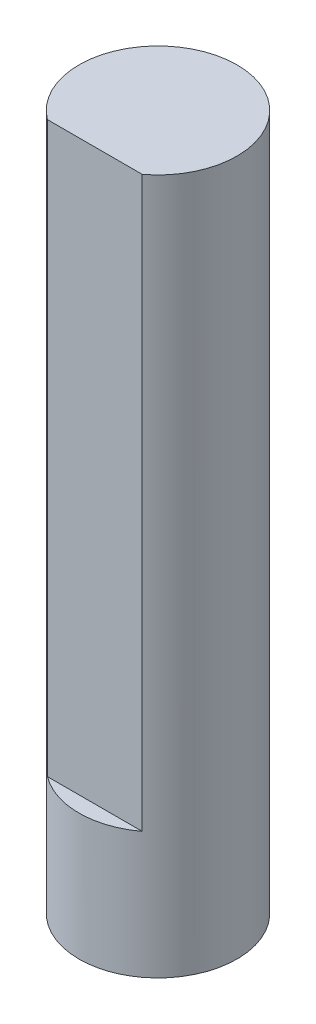
ISO-10303-21;
HEADER;
FILE_DESCRIPTION(('STEP AP214'),'2;1');
FILE_NAME('part.step','',(''),(''),'','','');
FILE_SCHEMA(('AUTOMOTIVE_DESIGN { 1 0 10303 214 1 1 1 1 }'));
ENDSEC;
DATA;
#1=APPLICATION_CONTEXT('core data for automotive mechanical design processes');
#2=APPLICATION_PROTOCOL_DEFINITION('international standard','automotive_design',2000,#1);
#3=PRODUCT_CONTEXT('',#1,'mechanical');
#4=PRODUCT('Part','Part','',(#3));
#5=PRODUCT_RELATED_PRODUCT_CATEGORY('part','',(#4));
#6=PRODUCT_DEFINITION_FORMATION('','',#4);
#7=PRODUCT_DEFINITION_CONTEXT('part definition',#1,'design');
#8=PRODUCT_DEFINITION('design','',#6,#7);
#9=PRODUCT_DEFINITION_SHAPE('','',#8);
#10=(LENGTH_UNIT() NAMED_UNIT(*) SI_UNIT(.MILLI.,.METRE.));
#11=(NAMED_UNIT(*) PLANE_ANGLE_UNIT() SI_UNIT($,.RADIAN.));
#12=(NAMED_UNIT(*) SI_UNIT($,.STERADIAN.) SOLID_ANGLE_UNIT());
#13=UNCERTAINTY_MEASURE_WITH_UNIT(LENGTH_MEASURE(1.E-05),#10,'distance_accuracy_value','');
#14=(GEOMETRIC_REPRESENTATION_CONTEXT(3) GLOBAL_UNCERTAINTY_ASSIGNED_CONTEXT((#13)) GLOBAL_UNIT_ASSIGNED_CONTEXT((#10,
#11,#12)) REPRESENTATION_CONTEXT('',''));
#15=CARTESIAN_POINT('',(0.,0.,0.));
#16=DIRECTION('',(0.,0.,1.));
#17=DIRECTION('',(1.,0.,0.));
#18=AXIS2_PLACEMENT_3D('',#15,#16,#17);
#19=CARTESIAN_POINT('',(0.,22.,0.));
#20=DIRECTION('',(0.,-1.,0.));
#21=DIRECTION('',(0.,0.,-1.));
#22=AXIS2_PLACEMENT_3D('',#19,#20,#21);
#23=CYLINDRICAL_SURFACE('',#22,2.5);
#24=CARTESIAN_POINT('',(0.,0.,0.));
#25=DIRECTION('',(0.,1.,0.));
#26=DIRECTION('',(0.,0.,1.));
#27=AXIS2_PLACEMENT_3D('',#24,#25,#26);
#28=CIRCLE('',#27,2.5);
#29=CARTESIAN_POINT('',(0.,0.,2.5));
#30=VERTEX_POINT('',#29);
#31=EDGE_CURVE('E76',#30,#30,#28,.T.);
#32=ORIENTED_EDGE('',*,*,#31,.T.);
#33=EDGE_LOOP('',(#32));
#34=FACE_BOUND('',#33,.T.);
#35=DIRECTION('',(0.,-1.,0.));
#36=VECTOR('',#35,1.);
#37=CARTESIAN_POINT('',(1.5,22.,2.));
#38=LINE('',#37,#36);
#39=CARTESIAN_POINT('',(1.5,4.,2.));
#40=VERTEX_POINT('',#39);
#41=CARTESIAN_POINT('',(1.5,22.,2.));
#42=VERTEX_POINT('',#41);
#43=EDGE_CURVE('E56',#40,#42,#38,.F.);
#44=ORIENTED_EDGE('',*,*,#43,.F.);
#45=CARTESIAN_POINT('',(0.,4.,0.));
#46=DIRECTION('',(0.,-1.,0.));
#47=DIRECTION('',(0.,0.,-1.));
#48=AXIS2_PLACEMENT_3D('',#45,#46,#47);
#49=CIRCLE('',#48,2.5);
#50=CARTESIAN_POINT('',(-1.5,4.,2.));
#51=VERTEX_POINT('',#50);
#52=EDGE_CURVE('E11',#40,#51,#49,.T.);
#53=ORIENTED_EDGE('',*,*,#52,.T.);
#54=DIRECTION('',(0.,-1.,0.));
#55=VECTOR('',#54,1.);
#56=CARTESIAN_POINT('',(-1.5,22.,2.));
#57=LINE('',#56,#55);
#58=CARTESIAN_POINT('',(-1.5,22.,2.));
#59=VERTEX_POINT('',#58);
#60=EDGE_CURVE('E68',#59,#51,#57,.T.);
#61=ORIENTED_EDGE('',*,*,#60,.F.);
#62=CARTESIAN_POINT('',(0.,22.,0.));
#63=DIRECTION('',(0.,1.,0.));
#64=DIRECTION('',(0.,0.,1.));
#65=AXIS2_PLACEMENT_3D('',#62,#63,#64);
#66=CIRCLE('',#65,2.5);
#67=EDGE_CURVE('E73',#42,#59,#66,.T.);
#68=ORIENTED_EDGE('',*,*,#67,.F.);
#69=EDGE_LOOP('',(#44,#53,#61,#68));
#70=FACE_BOUND('',#69,.T.);
#71=ADVANCED_FACE('F41',(#34,#70),#23,.T.);
#72=CARTESIAN_POINT('',(0.,22.,0.));
#73=DIRECTION('',(0.,1.,0.));
#74=DIRECTION('',(0.,0.,1.));
#75=AXIS2_PLACEMENT_3D('',#72,#73,#74);
#76=PLANE('',#75);
#77=ORIENTED_EDGE('',*,*,#67,.T.);
#78=DIRECTION('',(1.,0.,0.));
#79=VECTOR('',#78,1.);
#80=CARTESIAN_POINT('',(0.,22.,2.));
#81=LINE('',#80,#79);
#82=EDGE_CURVE('E49',#59,#42,#81,.T.);
#83=ORIENTED_EDGE('',*,*,#82,.T.);
#84=EDGE_LOOP('',(#77,#83));
#85=FACE_BOUND('',#84,.T.);
#86=ADVANCED_FACE('F78',(#85),#76,.T.);
#87=CARTESIAN_POINT('',(0.,0.,0.));
#88=DIRECTION('',(0.,1.,0.));
#89=DIRECTION('',(0.,0.,1.));
#90=AXIS2_PLACEMENT_3D('',#87,#88,#89);
#91=PLANE('',#90);
#92=ORIENTED_EDGE('',*,*,#31,.F.);
#93=EDGE_LOOP('',(#92));
#94=FACE_BOUND('',#93,.T.);
#95=ADVANCED_FACE('F91',(#94),#91,.F.);
#96=CARTESIAN_POINT('',(-2.5,4.,2.));
#97=DIRECTION('',(0.,-1.,0.));
#98=DIRECTION('',(0.,0.,-1.));
#99=AXIS2_PLACEMENT_3D('',#96,#97,#98);
#100=PLANE('',#99);
#101=DIRECTION('',(1.,0.,0.));
#102=VECTOR('',#101,1.);
#103=CARTESIAN_POINT('',(-2.5,4.,2.));
#104=LINE('',#103,#102);
#105=EDGE_CURVE('E87',#51,#40,#104,.T.);
#106=ORIENTED_EDGE('',*,*,#105,.F.);
#107=ORIENTED_EDGE('',*,*,#52,.F.);
#108=EDGE_LOOP('',(#106,#107));
#109=FACE_BOUND('',#108,.T.);
#110=ADVANCED_FACE('F89',(#109),#100,.F.);
#111=CARTESIAN_POINT('',(0.,0.,2.));
#112=DIRECTION('',(0.,0.,1.));
#113=DIRECTION('',(1.,0.,0.));
#114=AXIS2_PLACEMENT_3D('',#111,#112,#113);
#115=PLANE('',#114);
#116=ORIENTED_EDGE('',*,*,#60,.T.);
#117=ORIENTED_EDGE('',*,*,#105,.T.);
#118=ORIENTED_EDGE('',*,*,#43,.T.);
#119=ORIENTED_EDGE('',*,*,#82,.F.);
#120=EDGE_LOOP('',(#116,#117,#118,#119));
#121=FACE_BOUND('',#120,.T.);
#122=ADVANCED_FACE('F67',(#121),#115,.T.);
#123=CLOSED_SHELL('',(#71,#86,#95,#110,#122));
#124=MANIFOLD_SOLID_BREP('B2',#123);
#125=ADVANCED_BREP_SHAPE_REPRESENTATION('',(#18,#124),#14);
#126=SHAPE_DEFINITION_REPRESENTATION(#9,#125);
ENDSEC;
END-ISO-10303-21;
